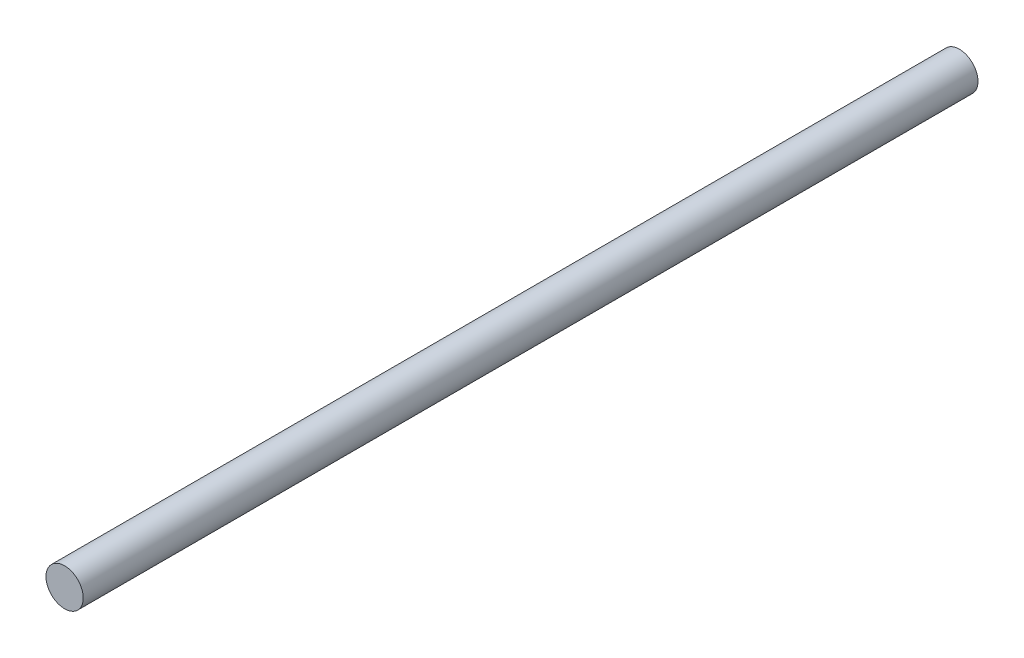
ISO-10303-21;
HEADER;
FILE_DESCRIPTION(('STEP AP214'),'2;1');
FILE_NAME('part.step','',(''),(''),'','','');
FILE_SCHEMA(('AUTOMOTIVE_DESIGN { 1 0 10303 214 1 1 1 1 }'));
ENDSEC;
DATA;
#1=APPLICATION_CONTEXT('core data for automotive mechanical design processes');
#2=APPLICATION_PROTOCOL_DEFINITION('international standard','automotive_design',2000,#1);
#3=PRODUCT_CONTEXT('',#1,'mechanical');
#4=PRODUCT('Part','Part','',(#3));
#5=PRODUCT_RELATED_PRODUCT_CATEGORY('part','',(#4));
#6=PRODUCT_DEFINITION_FORMATION('','',#4);
#7=PRODUCT_DEFINITION_CONTEXT('part definition',#1,'design');
#8=PRODUCT_DEFINITION('design','',#6,#7);
#9=PRODUCT_DEFINITION_SHAPE('','',#8);
#10=(LENGTH_UNIT() NAMED_UNIT(*) SI_UNIT(.MILLI.,.METRE.));
#11=(NAMED_UNIT(*) PLANE_ANGLE_UNIT() SI_UNIT($,.RADIAN.));
#12=(NAMED_UNIT(*) SI_UNIT($,.STERADIAN.) SOLID_ANGLE_UNIT());
#13=UNCERTAINTY_MEASURE_WITH_UNIT(LENGTH_MEASURE(1.E-05),#10,'distance_accuracy_value','');
#14=(GEOMETRIC_REPRESENTATION_CONTEXT(3) GLOBAL_UNCERTAINTY_ASSIGNED_CONTEXT((#13)) GLOBAL_UNIT_ASSIGNED_CONTEXT((#10,
#11,#12)) REPRESENTATION_CONTEXT('',''));
#15=CARTESIAN_POINT('',(0.,0.,0.));
#16=DIRECTION('',(0.,0.,1.));
#17=DIRECTION('',(1.,0.,0.));
#18=AXIS2_PLACEMENT_3D('',#15,#16,#17);
#19=CARTESIAN_POINT('',(0.,0.,304.8));
#20=DIRECTION('',(0.,0.,-1.));
#21=DIRECTION('',(-1.,0.,0.));
#22=AXIS2_PLACEMENT_3D('',#19,#20,#21);
#23=CYLINDRICAL_SURFACE('',#22,6.35);
#24=CARTESIAN_POINT('',(0.,0.,304.8));
#25=DIRECTION('',(0.,0.,1.));
#26=DIRECTION('',(1.,0.,0.));
#27=AXIS2_PLACEMENT_3D('',#24,#25,#26);
#28=CIRCLE('',#27,6.35);
#29=CARTESIAN_POINT('',(6.35,0.,304.8));
#30=VERTEX_POINT('',#29);
#31=EDGE_CURVE('E10',#30,#30,#28,.T.);
#32=ORIENTED_EDGE('',*,*,#31,.F.);
#33=EDGE_LOOP('',(#32));
#34=FACE_BOUND('',#33,.T.);
#35=CARTESIAN_POINT('',(0.,0.,0.));
#36=DIRECTION('',(0.,0.,1.));
#37=DIRECTION('',(1.,0.,0.));
#38=AXIS2_PLACEMENT_3D('',#35,#36,#37);
#39=CIRCLE('',#38,6.35);
#40=CARTESIAN_POINT('',(6.35,0.,0.));
#41=VERTEX_POINT('',#40);
#42=EDGE_CURVE('E34',#41,#41,#39,.T.);
#43=ORIENTED_EDGE('',*,*,#42,.T.);
#44=EDGE_LOOP('',(#43));
#45=FACE_BOUND('',#44,.T.);
#46=ADVANCED_FACE('F31',(#34,#45),#23,.T.);
#47=CARTESIAN_POINT('',(0.,0.,304.8));
#48=DIRECTION('',(0.,0.,1.));
#49=DIRECTION('',(1.,0.,0.));
#50=AXIS2_PLACEMENT_3D('',#47,#48,#49);
#51=PLANE('',#50);
#52=ORIENTED_EDGE('',*,*,#31,.T.);
#53=EDGE_LOOP('',(#52));
#54=FACE_BOUND('',#53,.T.);
#55=ADVANCED_FACE('F46',(#54),#51,.T.);
#56=CARTESIAN_POINT('',(0.,0.,0.));
#57=DIRECTION('',(0.,0.,1.));
#58=DIRECTION('',(1.,0.,0.));
#59=AXIS2_PLACEMENT_3D('',#56,#57,#58);
#60=PLANE('',#59);
#61=ORIENTED_EDGE('',*,*,#42,.F.);
#62=EDGE_LOOP('',(#61));
#63=FACE_BOUND('',#62,.T.);
#64=ADVANCED_FACE('F44',(#63),#60,.F.);
#65=CLOSED_SHELL('',(#46,#55,#64));
#66=MANIFOLD_SOLID_BREP('B2',#65);
#67=ADVANCED_BREP_SHAPE_REPRESENTATION('',(#18,#66),#14);
#68=SHAPE_DEFINITION_REPRESENTATION(#9,#67);
ENDSEC;
END-ISO-10303-21;
